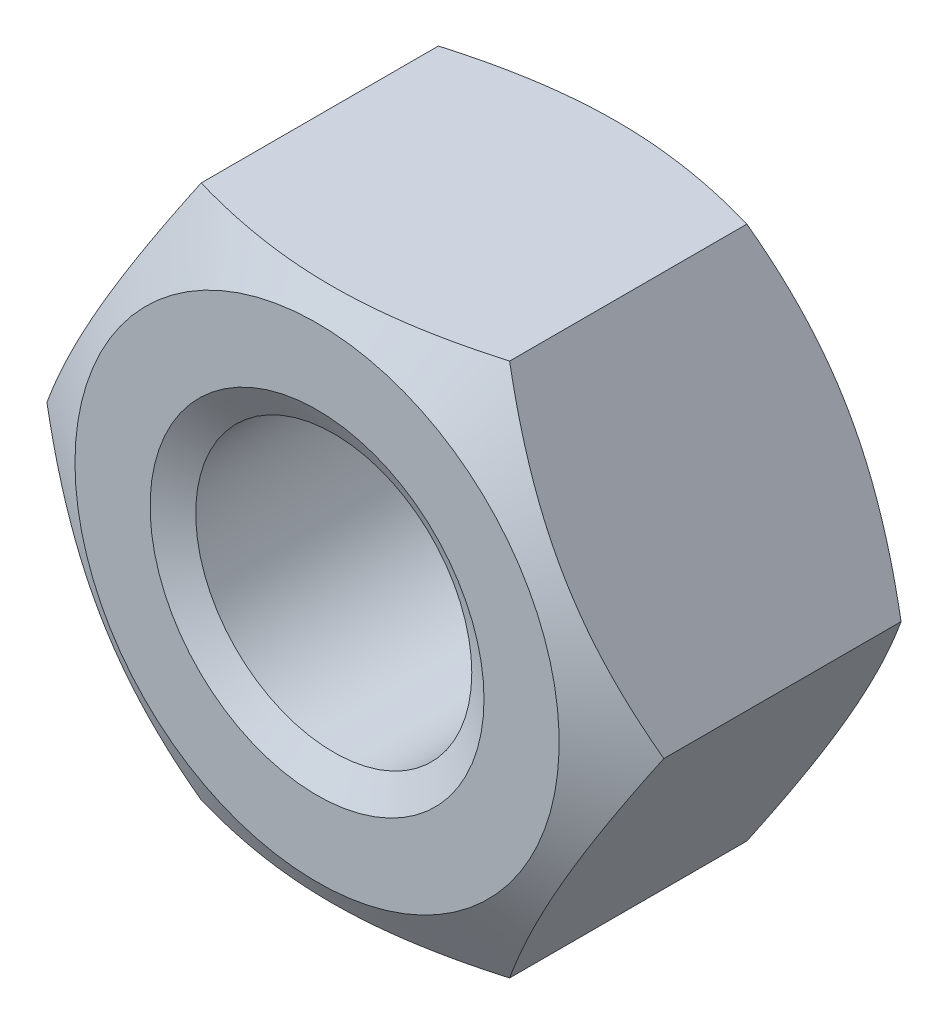
ISO-10303-21;
HEADER;
FILE_DESCRIPTION(('STEP AP214'),'2;1');
FILE_NAME('part.step','',(''),(''),'','','');
FILE_SCHEMA(('AUTOMOTIVE_DESIGN { 1 0 10303 214 1 1 1 1 }'));
ENDSEC;
DATA;
#1=APPLICATION_CONTEXT('core data for automotive mechanical design processes');
#2=APPLICATION_PROTOCOL_DEFINITION('international standard','automotive_design',2000,#1);
#3=PRODUCT_CONTEXT('',#1,'mechanical');
#4=PRODUCT('Part','Part','',(#3));
#5=PRODUCT_RELATED_PRODUCT_CATEGORY('part','',(#4));
#6=PRODUCT_DEFINITION_FORMATION('','',#4);
#7=PRODUCT_DEFINITION_CONTEXT('part definition',#1,'design');
#8=PRODUCT_DEFINITION('design','',#6,#7);
#9=PRODUCT_DEFINITION_SHAPE('','',#8);
#10=(LENGTH_UNIT() NAMED_UNIT(*) SI_UNIT(.MILLI.,.METRE.));
#11=(NAMED_UNIT(*) PLANE_ANGLE_UNIT() SI_UNIT($,.RADIAN.));
#12=(NAMED_UNIT(*) SI_UNIT($,.STERADIAN.) SOLID_ANGLE_UNIT());
#13=UNCERTAINTY_MEASURE_WITH_UNIT(LENGTH_MEASURE(1.E-05),#10,'distance_accuracy_value','');
#14=(GEOMETRIC_REPRESENTATION_CONTEXT(3) GLOBAL_UNCERTAINTY_ASSIGNED_CONTEXT((#13)) GLOBAL_UNIT_ASSIGNED_CONTEXT((#10,
#11,#12)) REPRESENTATION_CONTEXT('',''));
#15=CARTESIAN_POINT('',(0.,0.,0.));
#16=DIRECTION('',(0.,0.,1.));
#17=DIRECTION('',(1.,0.,0.));
#18=AXIS2_PLACEMENT_3D('',#15,#16,#17);
#19=CARTESIAN_POINT('',(2.3094010767585,-4.,-4.7));
#20=DIRECTION('',(0.866025403784439,-0.5,0.));
#21=DIRECTION('',(0.5,0.866025403784439,0.));
#22=AXIS2_PLACEMENT_3D('',#19,#20,#21);
#23=PLANE('',#22);
#24=CARTESIAN_POINT('',(2.30928560670467,-4.0002,-0.573838610020871));
#25=CARTESIAN_POINT('',(2.4107717464617,-3.82442084967677,-0.515224224594387));
#26=CARTESIAN_POINT('',(2.51313390883499,-3.64712438367362,-0.461916672408368));
#27=CARTESIAN_POINT('',(2.71963072479811,-3.28946140682429,-0.368868021692509));
#28=CARTESIAN_POINT('',(2.82376904741904,-3.10908854102985,-0.329159839975811));
#29=CARTESIAN_POINT('',(3.03075510011795,-2.75057818129721,-0.267348566226386));
#30=CARTESIAN_POINT('',(3.13357098372492,-2.57249584706486,-0.244834082468996));
#31=CARTESIAN_POINT('',(3.33968651028528,-2.21549328283349,-0.217956974092689));
#32=CARTESIAN_POINT('',(3.44298540411434,-2.0365743503559,-0.213572092373051));
#33=CARTESIAN_POINT('',(3.63600352522932,-1.70225715780327,-0.222696423886077));
#34=CARTESIAN_POINT('',(3.72575165335064,-1.54680884001294,-0.233965304934101));
#35=CARTESIAN_POINT('',(3.90466320392054,-1.23692494436495,-0.269680341744299));
#36=CARTESIAN_POINT('',(3.99382600759478,-1.08249043825587,-0.29413869665764));
#37=CARTESIAN_POINT('',(4.17310641015197,-0.771967672225423,-0.355282415865395));
#38=CARTESIAN_POINT('',(4.26320131938131,-0.615918711936898,-0.392226954600969));
#39=CARTESIAN_POINT('',(4.4420474282755,-0.306148164596161,-0.476076423494131));
#40=CARTESIAN_POINT('',(4.53080091904966,-0.152422609226221,-0.522961653158844));
#41=CARTESIAN_POINT('',(4.61891762357084,0.000199999999999867,-0.573838610020871));
#42=B_SPLINE_CURVE_WITH_KNOTS('',3,(#24,#25,#26,#27,#28,#29,#30,#31,#32,#33,#34,#35,#36,#37,#38,
#39,#40,#41),.UNSPECIFIED.,.F.,.F.,(4,2,2,2,2,2,2,2,4),(0.,0.634047835695965,1.26961969224543,
1.88946157213122,2.50854226669297,3.04757825393385,3.58711366126903,4.13861653143764,
4.68903648037743),.UNSPECIFIED.);
#43=CARTESIAN_POINT('',(2.30940107675851,-4.,-0.573771940854268));
#44=VERTEX_POINT('',#43);
#45=CARTESIAN_POINT('',(4.61880215351701,0.,-0.573771940854268));
#46=VERTEX_POINT('',#45);
#47=EDGE_CURVE('E49',#44,#46,#42,.T.);
#48=ORIENTED_EDGE('',*,*,#47,.F.);
#49=DIRECTION('',(0.,0.,1.));
#50=VECTOR('',#49,1.);
#51=CARTESIAN_POINT('',(2.3094010767585,-4.,-4.7));
#52=LINE('',#51,#50);
#53=CARTESIAN_POINT('',(2.30940107675851,-4.,-4.12622805914573));
#54=VERTEX_POINT('',#53);
#55=EDGE_CURVE('E113',#54,#44,#52,.T.);
#56=ORIENTED_EDGE('',*,*,#55,.F.);
#57=CARTESIAN_POINT('',(4.61891762357084,0.000200000000000424,-4.12616138997913));
#58=CARTESIAN_POINT('',(4.5174314838138,-0.175579150323227,-4.18477577540561));
#59=CARTESIAN_POINT('',(4.41506932144052,-0.35287561632638,-4.23808332759163));
#60=CARTESIAN_POINT('',(4.2085725054774,-0.710538593175705,-4.33113197830749));
#61=CARTESIAN_POINT('',(4.10443418285647,-0.89091145897015,-4.37084016002419));
#62=CARTESIAN_POINT('',(3.89744813015756,-1.24942181870279,-4.43265143377362));
#63=CARTESIAN_POINT('',(3.79463224655059,-1.42750415293514,-4.455165917531));
#64=CARTESIAN_POINT('',(3.58851671999023,-1.78450671716651,-4.48204302590731));
#65=CARTESIAN_POINT('',(3.48521782616117,-1.9634256496441,-4.48642790762695));
#66=CARTESIAN_POINT('',(3.29219970504619,-2.29774284219673,-4.47730357611392));
#67=CARTESIAN_POINT('',(3.20245157692486,-2.45319115998706,-4.4660346950659));
#68=CARTESIAN_POINT('',(3.02354002635497,-2.76307505563505,-4.4303196582557));
#69=CARTESIAN_POINT('',(2.93437722268073,-2.91750956174413,-4.40586130334236));
#70=CARTESIAN_POINT('',(2.75509682012354,-3.22803232777458,-4.34471758413461));
#71=CARTESIAN_POINT('',(2.6650019108942,-3.3840812880631,-4.30777304539903));
#72=CARTESIAN_POINT('',(2.48615580200001,-3.69385183540384,-4.22392357650587));
#73=CARTESIAN_POINT('',(2.39740231122585,-3.84757739077378,-4.17703834684116));
#74=CARTESIAN_POINT('',(2.30928560670467,-4.0002,-4.12616138997913));
#75=B_SPLINE_CURVE_WITH_KNOTS('',3,(#57,#58,#59,#60,#61,#62,#63,#64,#65,#66,#67,#68,#69,#70,#71,
#72,#73,#74),.UNSPECIFIED.,.F.,.F.,(4,2,2,2,2,2,2,2,4),(0.,0.634047835695965,1.26961969224543,
1.88946157213122,2.50854226669297,3.04757825393385,3.58711366126903,4.13861653143764,
4.68903648037743),.UNSPECIFIED.);
#76=CARTESIAN_POINT('',(4.61880215351701,0.,-4.12622805914573));
#77=VERTEX_POINT('',#76);
#78=EDGE_CURVE('E124',#77,#54,#75,.T.);
#79=ORIENTED_EDGE('',*,*,#78,.F.);
#80=DIRECTION('',(0.,0.,1.));
#81=VECTOR('',#80,1.);
#82=CARTESIAN_POINT('',(4.61880215351701,0.,-4.7));
#83=LINE('',#82,#81);
#84=EDGE_CURVE('E121',#77,#46,#83,.T.);
#85=ORIENTED_EDGE('',*,*,#84,.T.);
#86=EDGE_LOOP('',(#48,#56,#79,#85));
#87=FACE_BOUND('',#86,.T.);
#88=ADVANCED_FACE('F34',(#87),#23,.T.);
#89=CARTESIAN_POINT('',(-2.3094010767585,-4.,-4.7));
#90=DIRECTION('',(0.,-1.,0.));
#91=DIRECTION('',(1.,0.,0.));
#92=AXIS2_PLACEMENT_3D('',#89,#90,#91);
#93=PLANE('',#92);
#94=CARTESIAN_POINT('',(-6.09489331699833,-4.,-2.11613226173038));
#95=CARTESIAN_POINT('',(-5.91950199158532,-4.,-2.03149845459807));
#96=CARTESIAN_POINT('',(-5.7436925721675,-4.,-1.94771521780684));
#97=CARTESIAN_POINT('',(-5.39101133396244,-4.,-1.78233664211584));
#98=CARTESIAN_POINT('',(-5.21413933442482,-4.,-1.70074168913957));
#99=CARTESIAN_POINT('',(-4.85813636501619,-4.,-1.53979001519612));
#100=CARTESIAN_POINT('',(-4.67899824047163,-4.,-1.46044906154063));
#101=CARTESIAN_POINT('',(-4.31923849988964,-4.,-1.30521851480991));
#102=CARTESIAN_POINT('',(-4.13861696283161,-4.,-1.22932873937654));
#103=CARTESIAN_POINT('',(-3.77350114804517,-4.,-1.08107583925161));
#104=CARTESIAN_POINT('',(-3.58898622006285,-4.,-1.00876328993188));
#105=CARTESIAN_POINT('',(-3.21776937753349,-4.,-0.869876931083467));
#106=CARTESIAN_POINT('',(-3.03106722116187,-4.,-0.803303763046062));
#107=CARTESIAN_POINT('',(-2.65557248329156,-4.,-0.677706911421507));
#108=CARTESIAN_POINT('',(-2.46678541614049,-4.,-0.6186669118505));
#109=CARTESIAN_POINT('',(-2.08652902254336,-4.,-0.510073166125042));
#110=CARTESIAN_POINT('',(-1.89506057319283,-4.,-0.460516392300252));
#111=CARTESIAN_POINT('',(-1.50929874076738,-4.,-0.373311085934368));
#112=CARTESIAN_POINT('',(-1.3150042603301,-4.,-0.335667315782019));
#113=CARTESIAN_POINT('',(-0.924106700195844,-4.,-0.274847986643028));
#114=CARTESIAN_POINT('',(-0.727503612749948,-4.,-0.251672476233678));
#115=CARTESIAN_POINT('',(-0.334240681054093,-4.,-0.221840557573594));
#116=CARTESIAN_POINT('',(-0.137588730973181,-4.,-0.21508272035275));
#117=CARTESIAN_POINT('',(0.255527926530267,-4.,-0.218431875319228));
#118=CARTESIAN_POINT('',(0.451992668522464,-4.,-0.228534642277113));
#119=CARTESIAN_POINT('',(0.788354694260788,-4.,-0.259560117676578));
#120=CARTESIAN_POINT('',(0.928625472743277,-4.,-0.276641969877719));
#121=CARTESIAN_POINT('',(1.20806274563834,-4.,-0.318274124276917));
#122=CARTESIAN_POINT('',(1.34722906904318,-4.,-0.342825560736373));
#123=CARTESIAN_POINT('',(1.76329750447572,-4.,-0.426460434695633));
#124=CARTESIAN_POINT('',(2.038222841116,-4.,-0.495467674954611));
#125=CARTESIAN_POINT('',(2.44940900932118,-4.,-0.614199979526076));
#126=CARTESIAN_POINT('',(2.587823037779,-4.,-0.65688505084575));
#127=CARTESIAN_POINT('',(2.86331367400337,-4.,-0.746448608554551));
#128=CARTESIAN_POINT('',(3.00039016122187,-4.,-0.793327469113979));
#129=CARTESIAN_POINT('',(3.27252112795964,-4.,-0.890278730810599));
#130=CARTESIAN_POINT('',(3.40758266487531,-4.,-0.940331521681944));
#131=CARTESIAN_POINT('',(3.6765608261696,-4.,-1.04329523164742));
#132=CARTESIAN_POINT('',(3.81047782797977,-4.,-1.09620516282043));
#133=CARTESIAN_POINT('',(3.94391362276095,-4.,-1.15027525964932));
#134=B_SPLINE_CURVE_WITH_KNOTS('',3,(#94,#95,#96,#97,#98,#99,#100,#101,#102,#103,#104,#105,#106,
#107,#108,#109,#110,#111,#112,#113,#114,#115,#116,#117,#118,#119,#120,#121,#122,#123,#124,#125,
#126,#127,#128,#129,#130,#131,#132,#133),.UNSPECIFIED.,.F.,.F.,(4,2,2,2,2,2,2,2,2,2,2,2,2,2,2,2,
2,2,2,4),(0.,0.584238260270339,1.16857888753194,1.75631615786472,2.34402233634899,
2.93848518114124,3.53301438320072,4.12623321774329,4.71926234061146,5.31252823651338,
5.90579612429932,6.49538935484718,7.08483485684393,7.50854871041553,7.93232693736171,
8.78152355203656,9.21602908262365,9.65057341857472,10.0826543796044,10.514586883744),.UNSPECIFIED.);
#135=CARTESIAN_POINT('',(-2.3094010767585,-4.,-0.573771940854268));
#136=VERTEX_POINT('',#135);
#137=EDGE_CURVE('E106',#136,#44,#134,.T.);
#138=ORIENTED_EDGE('',*,*,#137,.F.);
#139=DIRECTION('',(0.,0.,1.));
#140=VECTOR('',#139,1.);
#141=CARTESIAN_POINT('',(-2.3094010767585,-4.,-4.7));
#142=LINE('',#141,#140);
#143=CARTESIAN_POINT('',(-2.3094010767585,-4.,-4.12622805914573));
#144=VERTEX_POINT('',#143);
#145=EDGE_CURVE('E105',#144,#136,#142,.T.);
#146=ORIENTED_EDGE('',*,*,#145,.F.);
#147=CARTESIAN_POINT('',(-6.09489331699833,-4.,-2.58386773826962));
#148=CARTESIAN_POINT('',(-5.91950199158532,-4.,-2.66850154540194));
#149=CARTESIAN_POINT('',(-5.7436925721675,-4.,-2.75228478219317));
#150=CARTESIAN_POINT('',(-5.39101133396244,-4.,-2.91766335788416));
#151=CARTESIAN_POINT('',(-5.21413933442482,-4.,-2.99925831086044));
#152=CARTESIAN_POINT('',(-4.85813636501619,-4.,-3.16020998480389));
#153=CARTESIAN_POINT('',(-4.67899824047163,-4.,-3.23955093845938));
#154=CARTESIAN_POINT('',(-4.31923849988964,-4.,-3.39478148519009));
#155=CARTESIAN_POINT('',(-4.13861696283161,-4.,-3.47067126062346));
#156=CARTESIAN_POINT('',(-3.77350114804517,-4.,-3.61892416074839));
#157=CARTESIAN_POINT('',(-3.58898622006285,-4.,-3.69123671006813));
#158=CARTESIAN_POINT('',(-3.21776937753349,-4.,-3.83012306891654));
#159=CARTESIAN_POINT('',(-3.03106722116187,-4.,-3.89669623695394));
#160=CARTESIAN_POINT('',(-2.65557248329156,-4.,-4.0222930885785));
#161=CARTESIAN_POINT('',(-2.4667854161405,-4.,-4.0813330881495));
#162=CARTESIAN_POINT('',(-2.08652902254336,-4.,-4.18992683387496));
#163=CARTESIAN_POINT('',(-1.89506057319283,-4.,-4.23948360769975));
#164=CARTESIAN_POINT('',(-1.50929874076738,-4.,-4.32668891406563));
#165=CARTESIAN_POINT('',(-1.3150042603301,-4.,-4.36433268421798));
#166=CARTESIAN_POINT('',(-0.924106700195844,-4.,-4.42515201335697));
#167=CARTESIAN_POINT('',(-0.727503612749948,-4.,-4.44832752376632));
#168=CARTESIAN_POINT('',(-0.334240681054093,-4.,-4.47815944242641));
#169=CARTESIAN_POINT('',(-0.137588730973182,-4.,-4.48491727964725));
#170=CARTESIAN_POINT('',(0.255527926530266,-4.,-4.48156812468077));
#171=CARTESIAN_POINT('',(0.451992668522462,-4.,-4.47146535772289));
#172=CARTESIAN_POINT('',(0.788354694260787,-4.,-4.44043988232342));
#173=CARTESIAN_POINT('',(0.928625472743277,-4.,-4.42335803012228));
#174=CARTESIAN_POINT('',(1.20806274563834,-4.,-4.38172587572308));
#175=CARTESIAN_POINT('',(1.34722906904319,-4.,-4.35717443926363));
#176=CARTESIAN_POINT('',(1.76329750447572,-4.,-4.27353956530437));
#177=CARTESIAN_POINT('',(2.038222841116,-4.,-4.20453232504539));
#178=CARTESIAN_POINT('',(2.44940900932119,-4.,-4.08580002047393));
#179=CARTESIAN_POINT('',(2.58782303777901,-4.,-4.04311494915425));
#180=CARTESIAN_POINT('',(2.86331367400337,-4.,-3.95355139144545));
#181=CARTESIAN_POINT('',(3.00039016122187,-4.,-3.90667253088602));
#182=CARTESIAN_POINT('',(3.27252112795964,-4.,-3.8097212691894));
#183=CARTESIAN_POINT('',(3.40758266487531,-4.,-3.75966847831806));
#184=CARTESIAN_POINT('',(3.67656082616961,-4.,-3.65670476835258));
#185=CARTESIAN_POINT('',(3.81047782797977,-4.,-3.60379483717957));
#186=CARTESIAN_POINT('',(3.94391362276096,-4.,-3.54972474035068));
#187=B_SPLINE_CURVE_WITH_KNOTS('',3,(#147,#148,#149,#150,#151,#152,#153,#154,#155,#156,#157,
#158,#159,#160,#161,#162,#163,#164,#165,#166,#167,#168,#169,#170,#171,#172,#173,#174,#175,#176,
#177,#178,#179,#180,#181,#182,#183,#184,#185,#186),.UNSPECIFIED.,.F.,.F.,(4,2,2,2,2,2,2,2,2,2,2,
2,2,2,2,2,2,2,2,4),(0.,0.584238260270337,1.16857888753193,1.75631615786472,2.34402233634899,
2.93848518114124,3.53301438320071,4.12623321774328,4.71926234061146,5.31252823651338,
5.90579612429932,6.49538935484717,7.08483485684392,7.50854871041552,7.9323269373617,
8.78152355203656,9.21602908262365,9.65057341857472,10.0826543796044,10.514586883744),.UNSPECIFIED.);
#188=EDGE_CURVE('E195',#54,#144,#187,.F.);
#189=ORIENTED_EDGE('',*,*,#188,.F.);
#190=ORIENTED_EDGE('',*,*,#55,.T.);
#191=EDGE_LOOP('',(#138,#146,#189,#190));
#192=FACE_BOUND('',#191,.T.);
#193=ADVANCED_FACE('F203',(#192),#93,.T.);
#194=CARTESIAN_POINT('',(-4.61880215351701,0.,-4.7));
#195=DIRECTION('',(-0.866025403784438,-0.5,0.));
#196=DIRECTION('',(0.5,-0.866025403784438,0.));
#197=AXIS2_PLACEMENT_3D('',#194,#195,#196);
#198=PLANE('',#197);
#199=CARTESIAN_POINT('',(-4.61891762357085,0.00019999999999926,-0.573838610020872));
#200=CARTESIAN_POINT('',(-4.51743148381381,-0.175579150323229,-0.515224224594388));
#201=CARTESIAN_POINT('',(-4.41506932144052,-0.352875616326381,-0.461916672408369));
#202=CARTESIAN_POINT('',(-4.2085725054774,-0.710538593175707,-0.368868021692511));
#203=CARTESIAN_POINT('',(-4.10443418285647,-0.890911458970151,-0.329159839975811));
#204=CARTESIAN_POINT('',(-3.89744813015756,-1.24942181870279,-0.267348566226387));
#205=CARTESIAN_POINT('',(-3.79463224655059,-1.42750415293514,-0.244834082468997));
#206=CARTESIAN_POINT('',(-3.58851671999023,-1.78450671716651,-0.21795697409269));
#207=CARTESIAN_POINT('',(-3.48521782616117,-1.9634256496441,-0.213572092373051));
#208=CARTESIAN_POINT('',(-3.29219970504619,-2.29774284219673,-0.222696423886078));
#209=CARTESIAN_POINT('',(-3.20245157692486,-2.45319115998707,-0.233965304934102));
#210=CARTESIAN_POINT('',(-3.02354002635497,-2.76307505563506,-0.2696803417443));
#211=CARTESIAN_POINT('',(-2.93437722268073,-2.91750956174413,-0.29413869665764));
#212=CARTESIAN_POINT('',(-2.75509682012354,-3.22803232777458,-0.355282415865395));
#213=CARTESIAN_POINT('',(-2.6650019108942,-3.3840812880631,-0.392226954600969));
#214=CARTESIAN_POINT('',(-2.48615580200001,-3.69385183540384,-0.476076423494132));
#215=CARTESIAN_POINT('',(-2.39740231122585,-3.84757739077378,-0.522961653158845));
#216=CARTESIAN_POINT('',(-2.30928560670467,-4.0002,-0.57383861002087));
#217=B_SPLINE_CURVE_WITH_KNOTS('',3,(#199,#200,#201,#202,#203,#204,#205,#206,#207,#208,#209,
#210,#211,#212,#213,#214,#215,#216),.UNSPECIFIED.,.F.,.F.,(4,2,2,2,2,2,2,2,4),(0.,
0.634047835695965,1.26961969224543,1.88946157213122,2.50854226669297,3.04757825393386,
3.58711366126903,4.13861653143764,4.68903648037743),.UNSPECIFIED.);
#218=CARTESIAN_POINT('',(-4.61880215351701,0.,-0.573771940854268));
#219=VERTEX_POINT('',#218);
#220=EDGE_CURVE('E89',#219,#136,#217,.T.);
#221=ORIENTED_EDGE('',*,*,#220,.F.);
#222=DIRECTION('',(0.,0.,1.));
#223=VECTOR('',#222,1.);
#224=CARTESIAN_POINT('',(-4.61880215351701,0.,-4.7));
#225=LINE('',#224,#223);
#226=CARTESIAN_POINT('',(-4.61880215351701,0.,-4.12622805914573));
#227=VERTEX_POINT('',#226);
#228=EDGE_CURVE('E103',#227,#219,#225,.T.);
#229=ORIENTED_EDGE('',*,*,#228,.F.);
#230=CARTESIAN_POINT('',(-2.30928560670467,-4.0002,-4.12616138997913));
#231=CARTESIAN_POINT('',(-2.41077174646171,-3.82442084967677,-4.18477577540561));
#232=CARTESIAN_POINT('',(-2.513133908835,-3.64712438367362,-4.23808332759163));
#233=CARTESIAN_POINT('',(-2.71963072479812,-3.28946140682429,-4.33113197830749));
#234=CARTESIAN_POINT('',(-2.82376904741904,-3.10908854102985,-4.37084016002419));
#235=CARTESIAN_POINT('',(-3.03075510011795,-2.75057818129721,-4.43265143377361));
#236=CARTESIAN_POINT('',(-3.13357098372492,-2.57249584706486,-4.455165917531));
#237=CARTESIAN_POINT('',(-3.33968651028528,-2.21549328283349,-4.48204302590731));
#238=CARTESIAN_POINT('',(-3.44298540411434,-2.0365743503559,-4.48642790762695));
#239=CARTESIAN_POINT('',(-3.63600352522932,-1.70225715780327,-4.47730357611392));
#240=CARTESIAN_POINT('',(-3.72575165335065,-1.54680884001294,-4.4660346950659));
#241=CARTESIAN_POINT('',(-3.90466320392054,-1.23692494436495,-4.4303196582557));
#242=CARTESIAN_POINT('',(-3.99382600759478,-1.08249043825587,-4.40586130334236));
#243=CARTESIAN_POINT('',(-4.17310641015197,-0.771967672225423,-4.3447175841346));
#244=CARTESIAN_POINT('',(-4.26320131938131,-0.615918711936899,-4.30777304539903));
#245=CARTESIAN_POINT('',(-4.4420474282755,-0.306148164596161,-4.22392357650587));
#246=CARTESIAN_POINT('',(-4.53080091904966,-0.152422609226222,-4.17703834684116));
#247=CARTESIAN_POINT('',(-4.61891762357085,0.000199999999999208,-4.12616138997913));
#248=B_SPLINE_CURVE_WITH_KNOTS('',3,(#230,#231,#232,#233,#234,#235,#236,#237,#238,#239,#240,
#241,#242,#243,#244,#245,#246,#247),.UNSPECIFIED.,.F.,.F.,(4,2,2,2,2,2,2,2,4),(0.,
0.634047835695966,1.26961969224543,1.88946157213122,2.50854226669297,3.04757825393385,
3.58711366126903,4.13861653143764,4.68903648037743),.UNSPECIFIED.);
#249=EDGE_CURVE('E189',#144,#227,#248,.T.);
#250=ORIENTED_EDGE('',*,*,#249,.F.);
#251=ORIENTED_EDGE('',*,*,#145,.T.);
#252=EDGE_LOOP('',(#221,#229,#250,#251));
#253=FACE_BOUND('',#252,.T.);
#254=ADVANCED_FACE('F101',(#253),#198,.T.);
#255=CARTESIAN_POINT('',(-2.3094010767585,4.,-4.7));
#256=DIRECTION('',(-0.866025403784439,0.5,0.));
#257=DIRECTION('',(-0.5,-0.866025403784439,0.));
#258=AXIS2_PLACEMENT_3D('',#255,#256,#257);
#259=PLANE('',#258);
#260=CARTESIAN_POINT('',(-2.30928560670467,4.0002,-0.573838610020871));
#261=CARTESIAN_POINT('',(-2.41077174646171,3.82442084967677,-0.515224224594387));
#262=CARTESIAN_POINT('',(-2.513133908835,3.64712438367362,-0.461916672408368));
#263=CARTESIAN_POINT('',(-2.71963072479812,3.28946140682429,-0.36886802169251));
#264=CARTESIAN_POINT('',(-2.82376904741904,3.10908854102985,-0.329159839975811));
#265=CARTESIAN_POINT('',(-3.03075510011795,2.75057818129721,-0.267348566226386));
#266=CARTESIAN_POINT('',(-3.13357098372492,2.57249584706486,-0.244834082468996));
#267=CARTESIAN_POINT('',(-3.33968651028528,2.21549328283349,-0.21795697409269));
#268=CARTESIAN_POINT('',(-3.44298540411434,2.0365743503559,-0.213572092373051));
#269=CARTESIAN_POINT('',(-3.63600352522932,1.70225715780327,-0.222696423886078));
#270=CARTESIAN_POINT('',(-3.72575165335065,1.54680884001294,-0.233965304934102));
#271=CARTESIAN_POINT('',(-3.90466320392054,1.23692494436495,-0.2696803417443));
#272=CARTESIAN_POINT('',(-3.99382600759478,1.08249043825587,-0.29413869665764));
#273=CARTESIAN_POINT('',(-4.17310641015197,0.771967672225423,-0.355282415865396));
#274=CARTESIAN_POINT('',(-4.26320131938131,0.615918711936898,-0.39222695460097));
#275=CARTESIAN_POINT('',(-4.4420474282755,0.306148164596161,-0.476076423494132));
#276=CARTESIAN_POINT('',(-4.53080091904966,0.152422609226221,-0.522961653158845));
#277=CARTESIAN_POINT('',(-4.61891762357085,-0.000200000000000498,-0.573838610020872));
#278=B_SPLINE_CURVE_WITH_KNOTS('',3,(#260,#261,#262,#263,#264,#265,#266,#267,#268,#269,#270,
#271,#272,#273,#274,#275,#276,#277),.UNSPECIFIED.,.F.,.F.,(4,2,2,2,2,2,2,2,4),(0.,
0.634047835695966,1.26961969224543,1.88946157213122,2.50854226669297,3.04757825393385,
3.58711366126903,4.13861653143764,4.68903648037743),.UNSPECIFIED.);
#279=CARTESIAN_POINT('',(-2.30940107675851,4.,-0.573771940854268));
#280=VERTEX_POINT('',#279);
#281=EDGE_CURVE('E85',#280,#219,#278,.T.);
#282=ORIENTED_EDGE('',*,*,#281,.F.);
#283=DIRECTION('',(0.,0.,1.));
#284=VECTOR('',#283,1.);
#285=CARTESIAN_POINT('',(-2.3094010767585,4.,-4.7));
#286=LINE('',#285,#284);
#287=CARTESIAN_POINT('',(-2.30940107675851,4.,-4.12622805914573));
#288=VERTEX_POINT('',#287);
#289=EDGE_CURVE('E111',#288,#280,#286,.T.);
#290=ORIENTED_EDGE('',*,*,#289,.F.);
#291=CARTESIAN_POINT('',(-4.61891762357085,-0.000200000000000778,-4.12616138997913));
#292=CARTESIAN_POINT('',(-4.51743148381381,0.175579150323227,-4.18477577540561));
#293=CARTESIAN_POINT('',(-4.41506932144052,0.35287561632638,-4.23808332759163));
#294=CARTESIAN_POINT('',(-4.2085725054774,0.710538593175705,-4.33113197830749));
#295=CARTESIAN_POINT('',(-4.10443418285647,0.890911458970149,-4.37084016002419));
#296=CARTESIAN_POINT('',(-3.89744813015756,1.24942181870279,-4.43265143377361));
#297=CARTESIAN_POINT('',(-3.7946322465506,1.42750415293514,-4.455165917531));
#298=CARTESIAN_POINT('',(-3.58851671999023,1.78450671716651,-4.48204302590731));
#299=CARTESIAN_POINT('',(-3.48521782616117,1.9634256496441,-4.48642790762695));
#300=CARTESIAN_POINT('',(-3.29219970504619,2.29774284219673,-4.47730357611392));
#301=CARTESIAN_POINT('',(-3.20245157692487,2.45319115998706,-4.4660346950659));
#302=CARTESIAN_POINT('',(-3.02354002635497,2.76307505563505,-4.4303196582557));
#303=CARTESIAN_POINT('',(-2.93437722268073,2.91750956174413,-4.40586130334236));
#304=CARTESIAN_POINT('',(-2.75509682012354,3.22803232777458,-4.34471758413461));
#305=CARTESIAN_POINT('',(-2.6650019108942,3.3840812880631,-4.30777304539903));
#306=CARTESIAN_POINT('',(-2.48615580200001,3.69385183540384,-4.22392357650587));
#307=CARTESIAN_POINT('',(-2.39740231122585,3.84757739077378,-4.17703834684116));
#308=CARTESIAN_POINT('',(-2.30928560670467,4.0002,-4.12616138997913));
#309=B_SPLINE_CURVE_WITH_KNOTS('',3,(#291,#292,#293,#294,#295,#296,#297,#298,#299,#300,#301,
#302,#303,#304,#305,#306,#307,#308),.UNSPECIFIED.,.F.,.F.,(4,2,2,2,2,2,2,2,4),(0.,
0.634047835695964,1.26961969224543,1.88946157213122,2.50854226669297,3.04757825393385,
3.58711366126903,4.13861653143764,4.68903648037743),.UNSPECIFIED.);
#310=EDGE_CURVE('E110',#227,#288,#309,.T.);
#311=ORIENTED_EDGE('',*,*,#310,.F.);
#312=ORIENTED_EDGE('',*,*,#228,.T.);
#313=EDGE_LOOP('',(#282,#290,#311,#312));
#314=FACE_BOUND('',#313,.T.);
#315=ADVANCED_FACE('F109',(#314),#259,.T.);
#316=CARTESIAN_POINT('',(2.3094010767585,4.,-4.7));
#317=DIRECTION('',(0.,1.,0.));
#318=DIRECTION('',(0.,0.,1.));
#319=AXIS2_PLACEMENT_3D('',#316,#317,#318);
#320=PLANE('',#319);
#321=CARTESIAN_POINT('',(-6.09489331698854,4.,-2.11613226172566));
#322=CARTESIAN_POINT('',(-5.91950199157587,4.,-2.03149845459354));
#323=CARTESIAN_POINT('',(-5.74369257215839,4.,-1.94771521780252));
#324=CARTESIAN_POINT('',(-5.39101133395399,4.,-1.78233664211192));
#325=CARTESIAN_POINT('',(-5.21413933441671,4.,-1.70074168913585));
#326=CARTESIAN_POINT('',(-4.85813636500876,4.,-1.53979001519281));
#327=CARTESIAN_POINT('',(-4.67899824046454,4.,-1.46044906153752));
#328=CARTESIAN_POINT('',(-4.31923849988323,4.,-1.3052185148072));
#329=CARTESIAN_POINT('',(-4.13861696282555,4.,-1.22932873937403));
#330=CARTESIAN_POINT('',(-3.7735011480398,4.,-1.08107583924949));
#331=CARTESIAN_POINT('',(-3.58898622005784,4.,-1.00876328992995));
#332=CARTESIAN_POINT('',(-3.21776937752919,4.,-0.869876931081914));
#333=CARTESIAN_POINT('',(-3.03106722115793,4.,-0.803303763044692));
#334=CARTESIAN_POINT('',(-2.65557248328835,4.,-0.677706911420485));
#335=CARTESIAN_POINT('',(-2.46678541613765,4.,-0.618666911849643));
#336=CARTESIAN_POINT('',(-2.08652902254126,4.,-0.510073166124486));
#337=CARTESIAN_POINT('',(-1.8950605731911,4.,-0.460516392299832));
#338=CARTESIAN_POINT('',(-1.50929874076661,4.,-0.373311085934224));
#339=CARTESIAN_POINT('',(-1.31500426032993,4.,-0.335667315782002));
#340=CARTESIAN_POINT('',(-0.924106700196857,4.,-0.274847986643176));
#341=CARTESIAN_POINT('',(-0.727503612751563,4.,-0.251672476233863));
#342=CARTESIAN_POINT('',(-0.334240681056909,4.,-0.221840557573747));
#343=CARTESIAN_POINT('',(-0.137588730976597,4.,-0.215082720352835));
#344=CARTESIAN_POINT('',(0.255527926525664,4.,-0.218431875319075));
#345=CARTESIAN_POINT('',(0.451992668517272,4.,-0.228534642276791));
#346=CARTESIAN_POINT('',(0.788354694254841,4.,-0.259560117675916));
#347=CARTESIAN_POINT('',(0.928625472737157,4.,-0.276641969876923));
#348=CARTESIAN_POINT('',(1.20806274563188,4.,-0.318274124275841));
#349=CARTESIAN_POINT('',(1.34722906903656,4.,-0.342825560735152));
#350=CARTESIAN_POINT('',(1.7632975044686,4.,-0.426460434693978));
#351=CARTESIAN_POINT('',(2.03822284110857,4.,-0.495467674952662));
#352=CARTESIAN_POINT('',(2.44940900931328,4.,-0.614199979523693));
#353=CARTESIAN_POINT('',(2.58782303777094,4.,-0.656885050843221));
#354=CARTESIAN_POINT('',(2.86331367399499,4.,-0.746448608551735));
#355=CARTESIAN_POINT('',(3.00039016121333,4.,-0.793327469111021));
#356=CARTESIAN_POINT('',(3.27252112795078,4.,-0.890278730807362));
#357=CARTESIAN_POINT('',(3.40758266486629,4.,-0.94033152167857));
#358=CARTESIAN_POINT('',(3.67656082616028,4.,-1.04329523164377));
#359=CARTESIAN_POINT('',(3.81047782797029,4.,-1.09620516281665));
#360=CARTESIAN_POINT('',(3.94391362275132,4.,-1.15027525964541));
#361=B_SPLINE_CURVE_WITH_KNOTS('',3,(#321,#322,#323,#324,#325,#326,#327,#328,#329,#330,#331,
#332,#333,#334,#335,#336,#337,#338,#339,#340,#341,#342,#343,#344,#345,#346,#347,#348,#349,#350,
#351,#352,#353,#354,#355,#356,#357,#358,#359,#360),.UNSPECIFIED.,.F.,.F.,(4,2,2,2,2,2,2,2,2,2,2,
2,2,2,2,2,2,2,2,4),(0.,0.58423826026917,1.1685788875296,1.7563161578612,2.34402233634429,
2.93848518113534,3.53301438319362,4.12623321773499,4.71926234060197,5.31252823650209,
5.90579612428623,6.4953893548323,7.08483485682727,7.5085487103983,7.93232693734391,
8.78152355201763,9.21602908260414,9.65057341855462,10.0826543795838,10.5145868837227),.UNSPECIFIED.);
#362=CARTESIAN_POINT('',(2.3094010767585,4.00000000000001,-0.573771940854268));
#363=VERTEX_POINT('',#362);
#364=EDGE_CURVE('E92',#363,#280,#361,.F.);
#365=ORIENTED_EDGE('',*,*,#364,.F.);
#366=DIRECTION('',(0.,0.,1.));
#367=VECTOR('',#366,1.);
#368=CARTESIAN_POINT('',(2.3094010767585,4.,-4.7));
#369=LINE('',#368,#367);
#370=CARTESIAN_POINT('',(2.3094010767585,4.,-4.12622805914574));
#371=VERTEX_POINT('',#370);
#372=EDGE_CURVE('E115',#371,#363,#369,.T.);
#373=ORIENTED_EDGE('',*,*,#372,.F.);
#374=CARTESIAN_POINT('',(-6.09489331698854,4.,-2.58386773827435));
#375=CARTESIAN_POINT('',(-5.91950199157587,4.,-2.66850154540646));
#376=CARTESIAN_POINT('',(-5.74369257215838,4.,-2.75228478219749));
#377=CARTESIAN_POINT('',(-5.39101133395399,4.,-2.91766335788808));
#378=CARTESIAN_POINT('',(-5.21413933441671,4.,-2.99925831086415));
#379=CARTESIAN_POINT('',(-4.85813636500876,4.,-3.1602099848072));
#380=CARTESIAN_POINT('',(-4.67899824046454,4.,-3.23955093846249));
#381=CARTESIAN_POINT('',(-4.31923849988323,4.,-3.3947814851928));
#382=CARTESIAN_POINT('',(-4.13861696282555,4.,-3.47067126062598));
#383=CARTESIAN_POINT('',(-3.7735011480398,4.,-3.61892416075051));
#384=CARTESIAN_POINT('',(-3.58898622005784,4.,-3.69123671007006));
#385=CARTESIAN_POINT('',(-3.21776937752919,4.,-3.83012306891809));
#386=CARTESIAN_POINT('',(-3.03106722115793,4.,-3.89669623695531));
#387=CARTESIAN_POINT('',(-2.65557248328835,4.,-4.02229308857952));
#388=CARTESIAN_POINT('',(-2.46678541613765,4.,-4.08133308815036));
#389=CARTESIAN_POINT('',(-2.08652902254126,4.,-4.18992683387552));
#390=CARTESIAN_POINT('',(-1.8950605731911,4.,-4.23948360770017));
#391=CARTESIAN_POINT('',(-1.50929874076661,4.,-4.32668891406578));
#392=CARTESIAN_POINT('',(-1.31500426032993,4.,-4.364332684218));
#393=CARTESIAN_POINT('',(-0.924106700196856,4.,-4.42515201335683));
#394=CARTESIAN_POINT('',(-0.727503612751563,4.,-4.44832752376614));
#395=CARTESIAN_POINT('',(-0.334240681056909,4.,-4.47815944242625));
#396=CARTESIAN_POINT('',(-0.137588730976597,4.,-4.48491727964717));
#397=CARTESIAN_POINT('',(0.255527926525664,4.,-4.48156812468093));
#398=CARTESIAN_POINT('',(0.451992668517271,4.,-4.47146535772321));
#399=CARTESIAN_POINT('',(0.788354694254841,4.,-4.44043988232408));
#400=CARTESIAN_POINT('',(0.928625472737157,4.,-4.42335803012308));
#401=CARTESIAN_POINT('',(1.20806274563188,4.,-4.38172587572416));
#402=CARTESIAN_POINT('',(1.34722906903656,4.,-4.35717443926485));
#403=CARTESIAN_POINT('',(1.76329750446861,4.,-4.27353956530602));
#404=CARTESIAN_POINT('',(2.03822284110857,4.,-4.20453232504734));
#405=CARTESIAN_POINT('',(2.44940900931329,4.,-4.08580002047631));
#406=CARTESIAN_POINT('',(2.58782303777095,4.,-4.04311494915678));
#407=CARTESIAN_POINT('',(2.863313673995,4.,-3.95355139144827));
#408=CARTESIAN_POINT('',(3.00039016121334,4.,-3.90667253088898));
#409=CARTESIAN_POINT('',(3.27252112795079,4.,-3.80972126919264));
#410=CARTESIAN_POINT('',(3.4075826648663,4.,-3.75966847832143));
#411=CARTESIAN_POINT('',(3.67656082616029,4.,-3.65670476835623));
#412=CARTESIAN_POINT('',(3.8104778279703,4.,-3.60379483718335));
#413=CARTESIAN_POINT('',(3.94391362275133,4.,-3.54972474035459));
#414=B_SPLINE_CURVE_WITH_KNOTS('',3,(#374,#375,#376,#377,#378,#379,#380,#381,#382,#383,#384,
#385,#386,#387,#388,#389,#390,#391,#392,#393,#394,#395,#396,#397,#398,#399,#400,#401,#402,#403,
#404,#405,#406,#407,#408,#409,#410,#411,#412,#413),.UNSPECIFIED.,.F.,.F.,(4,2,2,2,2,2,2,2,2,2,2,
2,2,2,2,2,2,2,2,4),(0.,0.584238260269169,1.1685788875296,1.7563161578612,2.34402233634429,
2.93848518113534,3.53301438319361,4.12623321773499,4.71926234060197,5.31252823650208,
5.90579612428622,6.4953893548323,7.08483485682726,7.5085487103983,7.93232693734391,
8.78152355201764,9.21602908260414,9.65057341855462,10.0826543795838,10.5145868837227),.UNSPECIFIED.);
#415=EDGE_CURVE('E57',#288,#371,#414,.T.);
#416=ORIENTED_EDGE('',*,*,#415,.F.);
#417=ORIENTED_EDGE('',*,*,#289,.T.);
#418=EDGE_LOOP('',(#365,#373,#416,#417));
#419=FACE_BOUND('',#418,.T.);
#420=ADVANCED_FACE('F226',(#419),#320,.T.);
#421=CARTESIAN_POINT('',(4.61880215351701,0.,-4.7));
#422=DIRECTION('',(0.866025403784438,0.5,0.));
#423=DIRECTION('',(-0.5,0.866025403784438,0.));
#424=AXIS2_PLACEMENT_3D('',#421,#422,#423);
#425=PLANE('',#424);
#426=CARTESIAN_POINT('',(4.61891762357084,-0.000199999999999615,-0.573838610020871));
#427=CARTESIAN_POINT('',(4.51743148381381,0.175579150323228,-0.515224224594387));
#428=CARTESIAN_POINT('',(4.41506932144052,0.352875616326381,-0.461916672408368));
#429=CARTESIAN_POINT('',(4.2085725054774,0.710538593175706,-0.368868021692509));
#430=CARTESIAN_POINT('',(4.10443418285647,0.89091145897015,-0.32915983997581));
#431=CARTESIAN_POINT('',(3.89744813015756,1.24942181870279,-0.267348566226386));
#432=CARTESIAN_POINT('',(3.79463224655059,1.42750415293514,-0.244834082468996));
#433=CARTESIAN_POINT('',(3.58851671999023,1.78450671716651,-0.217956974092689));
#434=CARTESIAN_POINT('',(3.48521782616117,1.9634256496441,-0.21357209237305));
#435=CARTESIAN_POINT('',(3.29219970504619,2.29774284219673,-0.222696423886077));
#436=CARTESIAN_POINT('',(3.20245157692486,2.45319115998706,-0.233965304934101));
#437=CARTESIAN_POINT('',(3.02354002635497,2.76307505563505,-0.269680341744299));
#438=CARTESIAN_POINT('',(2.93437722268072,2.91750956174413,-0.294138696657638));
#439=CARTESIAN_POINT('',(2.75509682012354,3.22803232777458,-0.355282415865394));
#440=CARTESIAN_POINT('',(2.6650019108942,3.3840812880631,-0.392226954600968));
#441=CARTESIAN_POINT('',(2.48615580200001,3.69385183540384,-0.476076423494131));
#442=CARTESIAN_POINT('',(2.39740231122585,3.84757739077378,-0.522961653158844));
#443=CARTESIAN_POINT('',(2.30928560670466,4.0002,-0.57383861002087));
#444=B_SPLINE_CURVE_WITH_KNOTS('',3,(#426,#427,#428,#429,#430,#431,#432,#433,#434,#435,#436,
#437,#438,#439,#440,#441,#442,#443),.UNSPECIFIED.,.F.,.F.,(4,2,2,2,2,2,2,2,4),(0.,
0.634047835695965,1.26961969224543,1.88946157213122,2.50854226669297,3.04757825393385,
3.58711366126903,4.13861653143764,4.68903648037743),.UNSPECIFIED.);
#445=EDGE_CURVE('E248',#46,#363,#444,.T.);
#446=ORIENTED_EDGE('',*,*,#445,.F.);
#447=ORIENTED_EDGE('',*,*,#84,.F.);
#448=CARTESIAN_POINT('',(2.30928560670466,4.0002,-4.12616138997913));
#449=CARTESIAN_POINT('',(2.4107717464617,3.82442084967677,-4.18477577540562));
#450=CARTESIAN_POINT('',(2.51313390883499,3.64712438367362,-4.23808332759163));
#451=CARTESIAN_POINT('',(2.71963072479811,3.28946140682429,-4.33113197830749));
#452=CARTESIAN_POINT('',(2.82376904741904,3.10908854102985,-4.37084016002419));
#453=CARTESIAN_POINT('',(3.03075510011795,2.75057818129721,-4.43265143377362));
#454=CARTESIAN_POINT('',(3.13357098372491,2.57249584706486,-4.45516591753101));
#455=CARTESIAN_POINT('',(3.33968651028528,2.21549328283349,-4.48204302590731));
#456=CARTESIAN_POINT('',(3.44298540411434,2.0365743503559,-4.48642790762695));
#457=CARTESIAN_POINT('',(3.63600352522932,1.70225715780327,-4.47730357611392));
#458=CARTESIAN_POINT('',(3.72575165335064,1.54680884001294,-4.4660346950659));
#459=CARTESIAN_POINT('',(3.90466320392054,1.23692494436495,-4.4303196582557));
#460=CARTESIAN_POINT('',(3.99382600759478,1.08249043825587,-4.40586130334236));
#461=CARTESIAN_POINT('',(4.17310641015197,0.771967672225423,-4.34471758413461));
#462=CARTESIAN_POINT('',(4.26320131938131,0.615918711936899,-4.30777304539903));
#463=CARTESIAN_POINT('',(4.4420474282755,0.306148164596161,-4.22392357650587));
#464=CARTESIAN_POINT('',(4.53080091904966,0.152422609226221,-4.17703834684116));
#465=CARTESIAN_POINT('',(4.61891762357084,-0.000199999999999655,-4.12616138997913));
#466=B_SPLINE_CURVE_WITH_KNOTS('',3,(#448,#449,#450,#451,#452,#453,#454,#455,#456,#457,#458,
#459,#460,#461,#462,#463,#464,#465),.UNSPECIFIED.,.F.,.F.,(4,2,2,2,2,2,2,2,4),(0.,
0.634047835695964,1.26961969224543,1.88946157213122,2.50854226669297,3.04757825393385,
3.58711366126903,4.13861653143764,4.68903648037743),.UNSPECIFIED.);
#467=EDGE_CURVE('E151',#371,#77,#466,.T.);
#468=ORIENTED_EDGE('',*,*,#467,.F.);
#469=ORIENTED_EDGE('',*,*,#372,.T.);
#470=EDGE_LOOP('',(#446,#447,#468,#469));
#471=FACE_BOUND('',#470,.T.);
#472=ADVANCED_FACE('F145',(#471),#425,.T.);
#473=CARTESIAN_POINT('',(4.61880215351701,0.,-4.7));
#474=DIRECTION('',(0.,0.,1.));
#475=DIRECTION('',(1.,0.,0.));
#476=AXIS2_PLACEMENT_3D('',#473,#474,#475);
#477=PLANE('',#476);
#478=CARTESIAN_POINT('',(0.,0.,-4.7));
#479=DIRECTION('',(0.,0.,1.));
#480=DIRECTION('',(1.,0.,0.));
#481=AXIS2_PLACEMENT_3D('',#478,#479,#480);
#482=CIRCLE('',#481,2.31699266655911);
#483=CARTESIAN_POINT('',(2.31699266655911,0.,-4.7));
#484=VERTEX_POINT('',#483);
#485=EDGE_CURVE('E125',#484,#484,#482,.T.);
#486=ORIENTED_EDGE('',*,*,#485,.T.);
#487=EDGE_LOOP('',(#486));
#488=FACE_BOUND('',#487,.T.);
#489=CARTESIAN_POINT('',(0.,0.,-4.7));
#490=DIRECTION('',(0.,0.,-1.));
#491=DIRECTION('',(-1.,0.,0.));
#492=AXIS2_PLACEMENT_3D('',#489,#490,#491);
#493=CIRCLE('',#492,3.625);
#494=CARTESIAN_POINT('',(-3.625,0.,-4.7));
#495=VERTEX_POINT('',#494);
#496=EDGE_CURVE('E149',#495,#495,#493,.T.);
#497=ORIENTED_EDGE('',*,*,#496,.T.);
#498=EDGE_LOOP('',(#497));
#499=FACE_BOUND('',#498,.T.);
#500=ADVANCED_FACE('F141',(#488,#499),#477,.F.);
#501=CARTESIAN_POINT('',(4.61880215351701,0.,0.));
#502=DIRECTION('',(0.,0.,1.));
#503=DIRECTION('',(1.,0.,0.));
#504=AXIS2_PLACEMENT_3D('',#501,#502,#503);
#505=PLANE('',#504);
#506=CARTESIAN_POINT('',(0.,0.,0.));
#507=DIRECTION('',(0.,0.,1.));
#508=DIRECTION('',(1.,0.,0.));
#509=AXIS2_PLACEMENT_3D('',#506,#507,#508);
#510=CIRCLE('',#509,2.5);
#511=CARTESIAN_POINT('',(2.5,0.,0.));
#512=VERTEX_POINT('',#511);
#513=EDGE_CURVE('E11',#512,#512,#510,.F.);
#514=ORIENTED_EDGE('',*,*,#513,.T.);
#515=EDGE_LOOP('',(#514));
#516=FACE_BOUND('',#515,.T.);
#517=CARTESIAN_POINT('',(0.,0.,0.));
#518=DIRECTION('',(0.,0.,-1.));
#519=DIRECTION('',(-1.,0.,0.));
#520=AXIS2_PLACEMENT_3D('',#517,#518,#519);
#521=CIRCLE('',#520,3.625);
#522=CARTESIAN_POINT('',(-3.625,0.,0.));
#523=VERTEX_POINT('',#522);
#524=EDGE_CURVE('E249',#523,#523,#521,.T.);
#525=ORIENTED_EDGE('',*,*,#524,.F.);
#526=EDGE_LOOP('',(#525));
#527=FACE_BOUND('',#526,.T.);
#528=ADVANCED_FACE('F144',(#516,#527),#505,.T.);
#529=CARTESIAN_POINT('',(0.,0.,-4.7));
#530=DIRECTION('',(0.,0.,1.));
#531=DIRECTION('',(1.,0.,0.));
#532=AXIS2_PLACEMENT_3D('',#529,#530,#531);
#533=CYLINDRICAL_SURFACE('',#532,2.067);
#534=CARTESIAN_POINT('',(0.,0.,-4.267));
#535=DIRECTION('',(0.,0.,1.));
#536=DIRECTION('',(1.,0.,0.));
#537=AXIS2_PLACEMENT_3D('',#534,#535,#536);
#538=CIRCLE('',#537,2.067);
#539=CARTESIAN_POINT('',(2.067,0.,-4.267));
#540=VERTEX_POINT('',#539);
#541=EDGE_CURVE('E42',#540,#540,#538,.F.);
#542=ORIENTED_EDGE('',*,*,#541,.T.);
#543=EDGE_LOOP('',(#542));
#544=FACE_BOUND('',#543,.T.);
#545=CARTESIAN_POINT('',(0.,0.,-0.249992666559108));
#546=DIRECTION('',(0.,0.,1.));
#547=DIRECTION('',(1.,0.,0.));
#548=AXIS2_PLACEMENT_3D('',#545,#546,#547);
#549=CIRCLE('',#548,2.067);
#550=CARTESIAN_POINT('',(2.067,0.,-0.249992666559108));
#551=VERTEX_POINT('',#550);
#552=EDGE_CURVE('E128',#551,#551,#549,.T.);
#553=ORIENTED_EDGE('',*,*,#552,.T.);
#554=EDGE_LOOP('',(#553));
#555=FACE_BOUND('',#554,.T.);
#556=ADVANCED_FACE('F133',(#544,#555),#533,.F.);
#557=CARTESIAN_POINT('',(0.,0.,-4.12622805914573));
#558=DIRECTION('',(0.,0.,1.));
#559=DIRECTION('',(1.,0.,0.));
#560=AXIS2_PLACEMENT_3D('',#557,#558,#559);
#561=CONICAL_SURFACE('',#560,4.61880215351701,1.0471975511966);
#562=ORIENTED_EDGE('',*,*,#78,.T.);
#563=ORIENTED_EDGE('',*,*,#188,.T.);
#564=ORIENTED_EDGE('',*,*,#249,.T.);
#565=ORIENTED_EDGE('',*,*,#310,.T.);
#566=ORIENTED_EDGE('',*,*,#415,.T.);
#567=ORIENTED_EDGE('',*,*,#467,.T.);
#568=EDGE_LOOP('',(#562,#563,#564,#565,#566,#567));
#569=FACE_BOUND('',#568,.T.);
#570=ORIENTED_EDGE('',*,*,#496,.F.);
#571=EDGE_LOOP('',(#570));
#572=FACE_BOUND('',#571,.T.);
#573=ADVANCED_FACE('F173',(#569,#572),#561,.T.);
#574=CARTESIAN_POINT('',(0.,0.,0.));
#575=DIRECTION('',(0.,0.,-1.));
#576=DIRECTION('',(-1.,0.,0.));
#577=AXIS2_PLACEMENT_3D('',#574,#575,#576);
#578=CONICAL_SURFACE('',#577,3.625,1.0471975511966);
#579=ORIENTED_EDGE('',*,*,#47,.T.);
#580=ORIENTED_EDGE('',*,*,#445,.T.);
#581=ORIENTED_EDGE('',*,*,#364,.T.);
#582=ORIENTED_EDGE('',*,*,#281,.T.);
#583=ORIENTED_EDGE('',*,*,#220,.T.);
#584=ORIENTED_EDGE('',*,*,#137,.T.);
#585=EDGE_LOOP('',(#579,#580,#581,#582,#583,#584));
#586=FACE_BOUND('',#585,.T.);
#587=ORIENTED_EDGE('',*,*,#524,.T.);
#588=EDGE_LOOP('',(#587));
#589=FACE_BOUND('',#588,.T.);
#590=ADVANCED_FACE('F87',(#586,#589),#578,.T.);
#591=CARTESIAN_POINT('',(0.,0.,-4.7));
#592=DIRECTION('',(0.,0.,-1.));
#593=DIRECTION('',(-1.,0.,0.));
#594=AXIS2_PLACEMENT_3D('',#591,#592,#593);
#595=CONICAL_SURFACE('',#594,2.31699266655911,0.523598775598298);
#596=ORIENTED_EDGE('',*,*,#541,.F.);
#597=EDGE_LOOP('',(#596));
#598=FACE_BOUND('',#597,.T.);
#599=ORIENTED_EDGE('',*,*,#485,.F.);
#600=EDGE_LOOP('',(#599));
#601=FACE_BOUND('',#600,.T.);
#602=ADVANCED_FACE('F136',(#598,#601),#595,.F.);
#603=CARTESIAN_POINT('',(0.,0.,-0.249992666559108));
#604=DIRECTION('',(0.,0.,1.));
#605=DIRECTION('',(1.,0.,0.));
#606=AXIS2_PLACEMENT_3D('',#603,#604,#605);
#607=CONICAL_SURFACE('',#606,2.067,1.0471975511966);
#608=ORIENTED_EDGE('',*,*,#513,.F.);
#609=EDGE_LOOP('',(#608));
#610=FACE_BOUND('',#609,.T.);
#611=ORIENTED_EDGE('',*,*,#552,.F.);
#612=EDGE_LOOP('',(#611));
#613=FACE_BOUND('',#612,.T.);
#614=ADVANCED_FACE('F36',(#610,#613),#607,.F.);
#615=CLOSED_SHELL('',(#88,#193,#254,#315,#420,#472,#500,#528,#556,#573,#590,#602,#614));
#616=MANIFOLD_SOLID_BREP('B2',#615);
#617=ADVANCED_BREP_SHAPE_REPRESENTATION('',(#18,#616),#14);
#618=SHAPE_DEFINITION_REPRESENTATION(#9,#617);
ENDSEC;
END-ISO-10303-21;
